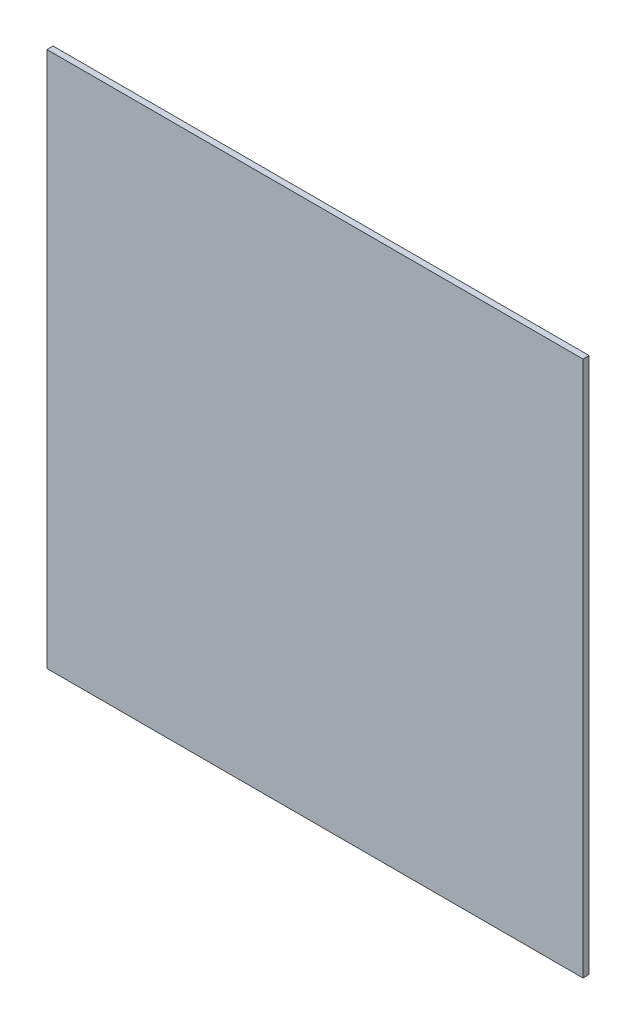
ISO-10303-21;
HEADER;
FILE_DESCRIPTION(('STEP AP214'),'2;1');
FILE_NAME('part.step','',(''),(''),'','','');
FILE_SCHEMA(('AUTOMOTIVE_DESIGN { 1 0 10303 214 1 1 1 1 }'));
ENDSEC;
DATA;
#1=APPLICATION_CONTEXT('core data for automotive mechanical design processes');
#2=APPLICATION_PROTOCOL_DEFINITION('international standard','automotive_design',2000,#1);
#3=PRODUCT_CONTEXT('',#1,'mechanical');
#4=PRODUCT('Part','Part','',(#3));
#5=PRODUCT_RELATED_PRODUCT_CATEGORY('part','',(#4));
#6=PRODUCT_DEFINITION_FORMATION('','',#4);
#7=PRODUCT_DEFINITION_CONTEXT('part definition',#1,'design');
#8=PRODUCT_DEFINITION('design','',#6,#7);
#9=PRODUCT_DEFINITION_SHAPE('','',#8);
#10=(LENGTH_UNIT() NAMED_UNIT(*) SI_UNIT(.MILLI.,.METRE.));
#11=(NAMED_UNIT(*) PLANE_ANGLE_UNIT() SI_UNIT($,.RADIAN.));
#12=(NAMED_UNIT(*) SI_UNIT($,.STERADIAN.) SOLID_ANGLE_UNIT());
#13=UNCERTAINTY_MEASURE_WITH_UNIT(LENGTH_MEASURE(1.E-05),#10,'distance_accuracy_value','');
#14=(GEOMETRIC_REPRESENTATION_CONTEXT(3) GLOBAL_UNCERTAINTY_ASSIGNED_CONTEXT((#13)) GLOBAL_UNIT_ASSIGNED_CONTEXT((#10,
#11,#12)) REPRESENTATION_CONTEXT('',''));
#15=CARTESIAN_POINT('',(0.,0.,0.));
#16=DIRECTION('',(0.,0.,1.));
#17=DIRECTION('',(1.,0.,0.));
#18=AXIS2_PLACEMENT_3D('',#15,#16,#17);
#19=CARTESIAN_POINT('',(0.,0.,2.5));
#20=DIRECTION('',(1.,0.,0.));
#21=DIRECTION('',(0.,0.,-1.));
#22=AXIS2_PLACEMENT_3D('',#19,#20,#21);
#23=PLANE('',#22);
#24=DIRECTION('',(0.,-1.,0.));
#25=VECTOR('',#24,1.);
#26=CARTESIAN_POINT('',(0.,0.,0.));
#27=LINE('',#26,#25);
#28=CARTESIAN_POINT('',(0.,220.,0.));
#29=VERTEX_POINT('',#28);
#30=CARTESIAN_POINT('',(0.,0.,0.));
#31=VERTEX_POINT('',#30);
#32=EDGE_CURVE('E95',#29,#31,#27,.T.);
#33=ORIENTED_EDGE('',*,*,#32,.T.);
#34=DIRECTION('',(0.,0.,-1.));
#35=VECTOR('',#34,1.);
#36=CARTESIAN_POINT('',(0.,0.,2.5));
#37=LINE('',#36,#35);
#38=CARTESIAN_POINT('',(0.,0.,2.5));
#39=VERTEX_POINT('',#38);
#40=EDGE_CURVE('E11',#39,#31,#37,.T.);
#41=ORIENTED_EDGE('',*,*,#40,.F.);
#42=DIRECTION('',(0.,-1.,0.));
#43=VECTOR('',#42,1.);
#44=CARTESIAN_POINT('',(0.,0.,2.5));
#45=LINE('',#44,#43);
#46=CARTESIAN_POINT('',(0.,220.,2.5));
#47=VERTEX_POINT('',#46);
#48=EDGE_CURVE('E83',#47,#39,#45,.T.);
#49=ORIENTED_EDGE('',*,*,#48,.F.);
#50=DIRECTION('',(0.,0.,-1.));
#51=VECTOR('',#50,1.);
#52=CARTESIAN_POINT('',(0.,220.,2.5));
#53=LINE('',#52,#51);
#54=EDGE_CURVE('E91',#47,#29,#53,.T.);
#55=ORIENTED_EDGE('',*,*,#54,.T.);
#56=EDGE_LOOP('',(#33,#41,#49,#55));
#57=FACE_BOUND('',#56,.T.);
#58=ADVANCED_FACE('F32',(#57),#23,.F.);
#59=CARTESIAN_POINT('',(0.,0.,2.5));
#60=DIRECTION('',(0.,1.,0.));
#61=DIRECTION('',(0.,0.,1.));
#62=AXIS2_PLACEMENT_3D('',#59,#60,#61);
#63=PLANE('',#62);
#64=DIRECTION('',(1.,0.,0.));
#65=VECTOR('',#64,1.);
#66=CARTESIAN_POINT('',(0.,0.,0.));
#67=LINE('',#66,#65);
#68=CARTESIAN_POINT('',(220.,0.,0.));
#69=VERTEX_POINT('',#68);
#70=EDGE_CURVE('E87',#31,#69,#67,.T.);
#71=ORIENTED_EDGE('',*,*,#70,.T.);
#72=DIRECTION('',(0.,0.,-1.));
#73=VECTOR('',#72,1.);
#74=CARTESIAN_POINT('',(220.,0.,2.5));
#75=LINE('',#74,#73);
#76=CARTESIAN_POINT('',(220.,0.,2.5));
#77=VERTEX_POINT('',#76);
#78=EDGE_CURVE('E40',#77,#69,#75,.T.);
#79=ORIENTED_EDGE('',*,*,#78,.F.);
#80=DIRECTION('',(1.,0.,0.));
#81=VECTOR('',#80,1.);
#82=CARTESIAN_POINT('',(0.,0.,2.5));
#83=LINE('',#82,#81);
#84=EDGE_CURVE('E78',#39,#77,#83,.T.);
#85=ORIENTED_EDGE('',*,*,#84,.F.);
#86=ORIENTED_EDGE('',*,*,#40,.T.);
#87=EDGE_LOOP('',(#71,#79,#85,#86));
#88=FACE_BOUND('',#87,.T.);
#89=ADVANCED_FACE('F86',(#88),#63,.F.);
#90=CARTESIAN_POINT('',(220.,0.,2.5));
#91=DIRECTION('',(-1.,0.,0.));
#92=DIRECTION('',(0.,0.,1.));
#93=AXIS2_PLACEMENT_3D('',#90,#91,#92);
#94=PLANE('',#93);
#95=DIRECTION('',(0.,1.,0.));
#96=VECTOR('',#95,1.);
#97=CARTESIAN_POINT('',(220.,0.,0.));
#98=LINE('',#97,#96);
#99=CARTESIAN_POINT('',(220.,220.,0.));
#100=VERTEX_POINT('',#99);
#101=EDGE_CURVE('E65',#69,#100,#98,.T.);
#102=ORIENTED_EDGE('',*,*,#101,.T.);
#103=DIRECTION('',(0.,0.,-1.));
#104=VECTOR('',#103,1.);
#105=CARTESIAN_POINT('',(220.,220.,2.5));
#106=LINE('',#105,#104);
#107=CARTESIAN_POINT('',(220.,220.,2.5));
#108=VERTEX_POINT('',#107);
#109=EDGE_CURVE('E88',#108,#100,#106,.T.);
#110=ORIENTED_EDGE('',*,*,#109,.F.);
#111=DIRECTION('',(0.,1.,0.));
#112=VECTOR('',#111,1.);
#113=CARTESIAN_POINT('',(220.,0.,2.5));
#114=LINE('',#113,#112);
#115=EDGE_CURVE('E81',#77,#108,#114,.T.);
#116=ORIENTED_EDGE('',*,*,#115,.F.);
#117=ORIENTED_EDGE('',*,*,#78,.T.);
#118=EDGE_LOOP('',(#102,#110,#116,#117));
#119=FACE_BOUND('',#118,.T.);
#120=ADVANCED_FACE('F89',(#119),#94,.F.);
#121=CARTESIAN_POINT('',(0.,220.,2.5));
#122=DIRECTION('',(0.,-1.,0.));
#123=DIRECTION('',(0.,0.,-1.));
#124=AXIS2_PLACEMENT_3D('',#121,#122,#123);
#125=PLANE('',#124);
#126=DIRECTION('',(-1.,0.,0.));
#127=VECTOR('',#126,1.);
#128=CARTESIAN_POINT('',(0.,220.,0.));
#129=LINE('',#128,#127);
#130=EDGE_CURVE('E71',#100,#29,#129,.T.);
#131=ORIENTED_EDGE('',*,*,#130,.T.);
#132=ORIENTED_EDGE('',*,*,#54,.F.);
#133=DIRECTION('',(-1.,0.,0.));
#134=VECTOR('',#133,1.);
#135=CARTESIAN_POINT('',(0.,220.,2.5));
#136=LINE('',#135,#134);
#137=EDGE_CURVE('E48',#108,#47,#136,.T.);
#138=ORIENTED_EDGE('',*,*,#137,.F.);
#139=ORIENTED_EDGE('',*,*,#109,.T.);
#140=EDGE_LOOP('',(#131,#132,#138,#139));
#141=FACE_BOUND('',#140,.T.);
#142=ADVANCED_FACE('F102',(#141),#125,.F.);
#143=CARTESIAN_POINT('',(0.,220.,2.5));
#144=DIRECTION('',(0.,0.,-1.));
#145=DIRECTION('',(-1.,0.,0.));
#146=AXIS2_PLACEMENT_3D('',#143,#144,#145);
#147=PLANE('',#146);
#148=ORIENTED_EDGE('',*,*,#48,.T.);
#149=ORIENTED_EDGE('',*,*,#84,.T.);
#150=ORIENTED_EDGE('',*,*,#115,.T.);
#151=ORIENTED_EDGE('',*,*,#137,.T.);
#152=EDGE_LOOP('',(#148,#149,#150,#151));
#153=FACE_BOUND('',#152,.T.);
#154=ADVANCED_FACE('F79',(#153),#147,.F.);
#155=CARTESIAN_POINT('',(0.,220.,0.));
#156=DIRECTION('',(0.,0.,-1.));
#157=DIRECTION('',(-1.,0.,0.));
#158=AXIS2_PLACEMENT_3D('',#155,#156,#157);
#159=PLANE('',#158);
#160=ORIENTED_EDGE('',*,*,#32,.F.);
#161=ORIENTED_EDGE('',*,*,#130,.F.);
#162=ORIENTED_EDGE('',*,*,#101,.F.);
#163=ORIENTED_EDGE('',*,*,#70,.F.);
#164=EDGE_LOOP('',(#160,#161,#162,#163));
#165=FACE_BOUND('',#164,.T.);
#166=ADVANCED_FACE('F105',(#165),#159,.T.);
#167=CLOSED_SHELL('',(#58,#89,#120,#142,#154,#166));
#168=MANIFOLD_SOLID_BREP('B2',#167);
#169=ADVANCED_BREP_SHAPE_REPRESENTATION('',(#18,#168),#14);
#170=SHAPE_DEFINITION_REPRESENTATION(#9,#169);
ENDSEC;
END-ISO-10303-21;
